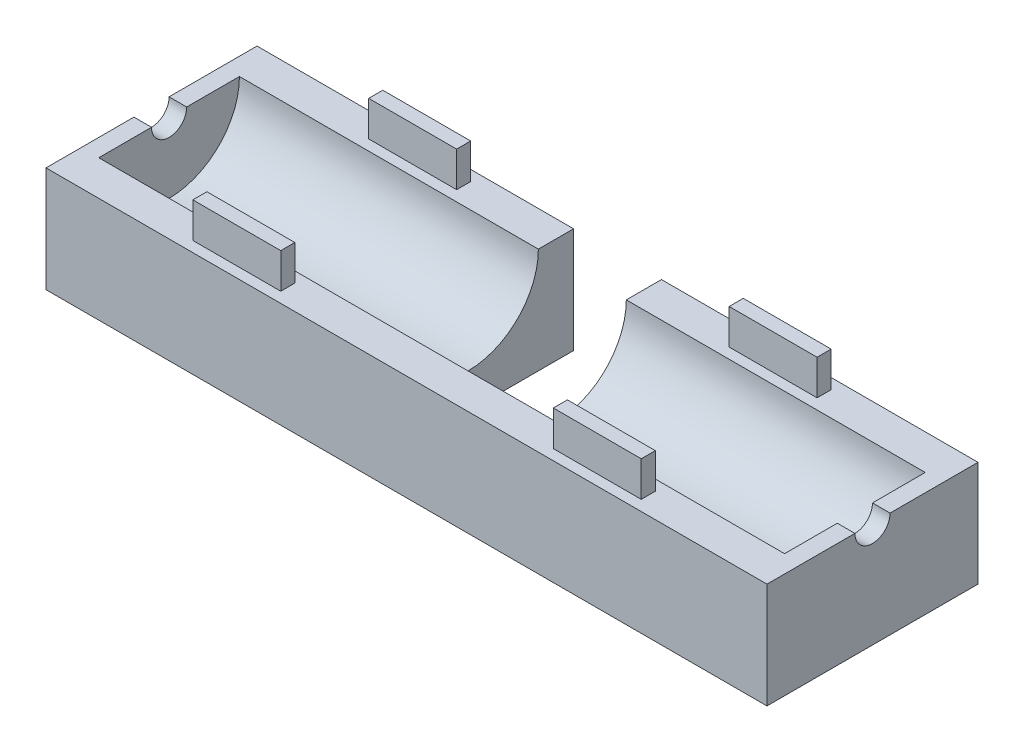
ISO-10303-21;
HEADER;
FILE_DESCRIPTION(('STEP AP214'),'2;1');
FILE_NAME('part.step','',(''),(''),'','','');
FILE_SCHEMA(('AUTOMOTIVE_DESIGN { 1 0 10303 214 1 1 1 1 }'));
ENDSEC;
DATA;
#1=APPLICATION_CONTEXT('core data for automotive mechanical design processes');
#2=APPLICATION_PROTOCOL_DEFINITION('international standard','automotive_design',2000,#1);
#3=PRODUCT_CONTEXT('',#1,'mechanical');
#4=PRODUCT('Part','Part','',(#3));
#5=PRODUCT_RELATED_PRODUCT_CATEGORY('part','',(#4));
#6=PRODUCT_DEFINITION_FORMATION('','',#4);
#7=PRODUCT_DEFINITION_CONTEXT('part definition',#1,'design');
#8=PRODUCT_DEFINITION('design','',#6,#7);
#9=PRODUCT_DEFINITION_SHAPE('','',#8);
#10=(LENGTH_UNIT() NAMED_UNIT(*) SI_UNIT(.MILLI.,.METRE.));
#11=(NAMED_UNIT(*) PLANE_ANGLE_UNIT() SI_UNIT($,.RADIAN.));
#12=(NAMED_UNIT(*) SI_UNIT($,.STERADIAN.) SOLID_ANGLE_UNIT());
#13=UNCERTAINTY_MEASURE_WITH_UNIT(LENGTH_MEASURE(1.E-05),#10,'distance_accuracy_value','');
#14=(GEOMETRIC_REPRESENTATION_CONTEXT(3) GLOBAL_UNCERTAINTY_ASSIGNED_CONTEXT((#13)) GLOBAL_UNIT_ASSIGNED_CONTEXT((#10,
#11,#12)) REPRESENTATION_CONTEXT('',''));
#15=CARTESIAN_POINT('',(0.,0.,0.));
#16=DIRECTION('',(0.,0.,1.));
#17=DIRECTION('',(1.,0.,0.));
#18=AXIS2_PLACEMENT_3D('',#15,#16,#17);
#19=CARTESIAN_POINT('',(20.5,6.,-4.));
#20=DIRECTION('',(0.,-1.,0.));
#21=DIRECTION('',(0.,0.,-1.));
#22=AXIS2_PLACEMENT_3D('',#19,#20,#21);
#23=PLANE('',#22);
#24=DIRECTION('',(-1.,0.,0.));
#25=VECTOR('',#24,1.);
#26=CARTESIAN_POINT('',(20.5,6.,-6.));
#27=LINE('',#26,#25);
#28=CARTESIAN_POINT('',(20.5,6.,-6.));
#29=VERTEX_POINT('',#28);
#30=CARTESIAN_POINT('',(2.5,6.,-6.));
#31=VERTEX_POINT('',#30);
#32=EDGE_CURVE('E457',#29,#31,#27,.T.);
#33=ORIENTED_EDGE('',*,*,#32,.T.);
#34=DIRECTION('',(0.,0.,1.));
#35=VECTOR('',#34,1.);
#36=CARTESIAN_POINT('',(2.5,6.,-4.));
#37=LINE('',#36,#35);
#38=CARTESIAN_POINT('',(2.5,6.,-4.));
#39=VERTEX_POINT('',#38);
#40=EDGE_CURVE('E411',#31,#39,#37,.T.);
#41=ORIENTED_EDGE('',*,*,#40,.T.);
#42=DIRECTION('',(-1.,0.,0.));
#43=VECTOR('',#42,1.);
#44=CARTESIAN_POINT('',(20.5,6.,-4.));
#45=LINE('',#44,#43);
#46=CARTESIAN_POINT('',(19.5,6.,-4.));
#47=VERTEX_POINT('',#46);
#48=EDGE_CURVE('E454',#47,#39,#45,.T.);
#49=ORIENTED_EDGE('',*,*,#48,.F.);
#50=DIRECTION('',(0.,0.,-1.));
#51=VECTOR('',#50,1.);
#52=CARTESIAN_POINT('',(19.5,6.,-4.));
#53=LINE('',#52,#51);
#54=CARTESIAN_POINT('',(19.5,6.,-1.));
#55=VERTEX_POINT('',#54);
#56=EDGE_CURVE('E369',#55,#47,#53,.T.);
#57=ORIENTED_EDGE('',*,*,#56,.F.);
#58=DIRECTION('',(1.,0.,0.));
#59=VECTOR('',#58,1.);
#60=CARTESIAN_POINT('',(19.5,6.,-1.));
#61=LINE('',#60,#59);
#62=CARTESIAN_POINT('',(20.5,6.,-1.));
#63=VERTEX_POINT('',#62);
#64=EDGE_CURVE('E374',#55,#63,#61,.T.);
#65=ORIENTED_EDGE('',*,*,#64,.T.);
#66=DIRECTION('',(0.,0.,1.));
#67=VECTOR('',#66,1.);
#68=CARTESIAN_POINT('',(20.5,6.,-4.));
#69=LINE('',#68,#67);
#70=EDGE_CURVE('E433',#29,#63,#69,.T.);
#71=ORIENTED_EDGE('',*,*,#70,.F.);
#72=EDGE_LOOP('',(#33,#41,#49,#57,#65,#71));
#73=FACE_BOUND('',#72,.T.);
#74=DIRECTION('',(-1.,0.,0.));
#75=VECTOR('',#74,1.);
#76=CARTESIAN_POINT('',(12.75,5.99999999999999,-5.4));
#77=LINE('',#76,#75);
#78=CARTESIAN_POINT('',(12.75,5.99999999999999,-5.4));
#79=VERTEX_POINT('',#78);
#80=CARTESIAN_POINT('',(7.75,6.,-5.4));
#81=VERTEX_POINT('',#80);
#82=EDGE_CURVE('E256',#79,#81,#77,.T.);
#83=ORIENTED_EDGE('',*,*,#82,.F.);
#84=DIRECTION('',(0.,0.,-1.));
#85=VECTOR('',#84,1.);
#86=CARTESIAN_POINT('',(12.75,5.99999999999999,-5.4));
#87=LINE('',#86,#85);
#88=CARTESIAN_POINT('',(12.75,6.,-4.6));
#89=VERTEX_POINT('',#88);
#90=EDGE_CURVE('E253',#89,#79,#87,.T.);
#91=ORIENTED_EDGE('',*,*,#90,.F.);
#92=DIRECTION('',(1.,0.,0.));
#93=VECTOR('',#92,1.);
#94=CARTESIAN_POINT('',(12.75,5.99999999999999,-4.6));
#95=LINE('',#94,#93);
#96=CARTESIAN_POINT('',(7.75,6.,-4.6));
#97=VERTEX_POINT('',#96);
#98=EDGE_CURVE('E53',#97,#89,#95,.T.);
#99=ORIENTED_EDGE('',*,*,#98,.F.);
#100=DIRECTION('',(0.,0.,1.));
#101=VECTOR('',#100,1.);
#102=CARTESIAN_POINT('',(7.75,5.99999999999999,-5.4));
#103=LINE('',#102,#101);
#104=EDGE_CURVE('E48',#81,#97,#103,.T.);
#105=ORIENTED_EDGE('',*,*,#104,.F.);
#106=EDGE_LOOP('',(#83,#91,#99,#105));
#107=FACE_BOUND('',#106,.T.);
#108=ADVANCED_FACE('F33',(#73,#107),#23,.F.);
#109=CARTESIAN_POINT('',(20.5,6.,6.));
#110=DIRECTION('',(0.,-1.,0.));
#111=DIRECTION('',(0.,0.,-1.));
#112=AXIS2_PLACEMENT_3D('',#109,#110,#111);
#113=PLANE('',#112);
#114=DIRECTION('',(1.,0.,0.));
#115=VECTOR('',#114,1.);
#116=CARTESIAN_POINT('',(-12.75,5.99999999999999,5.4));
#117=LINE('',#116,#115);
#118=CARTESIAN_POINT('',(-12.75,5.99999999999999,5.4));
#119=VERTEX_POINT('',#118);
#120=CARTESIAN_POINT('',(-7.75,6.,5.4));
#121=VERTEX_POINT('',#120);
#122=EDGE_CURVE('E295',#119,#121,#117,.T.);
#123=ORIENTED_EDGE('',*,*,#122,.F.);
#124=DIRECTION('',(0.,0.,1.));
#125=VECTOR('',#124,1.);
#126=CARTESIAN_POINT('',(-12.75,5.99999999999999,5.4));
#127=LINE('',#126,#125);
#128=CARTESIAN_POINT('',(-12.75,6.,4.6));
#129=VERTEX_POINT('',#128);
#130=EDGE_CURVE('E300',#129,#119,#127,.T.);
#131=ORIENTED_EDGE('',*,*,#130,.F.);
#132=DIRECTION('',(-1.,0.,0.));
#133=VECTOR('',#132,1.);
#134=CARTESIAN_POINT('',(-12.75,5.99999999999999,4.6));
#135=LINE('',#134,#133);
#136=CARTESIAN_POINT('',(-7.75,6.,4.6));
#137=VERTEX_POINT('',#136);
#138=EDGE_CURVE('E312',#137,#129,#135,.T.);
#139=ORIENTED_EDGE('',*,*,#138,.F.);
#140=DIRECTION('',(0.,0.,-1.));
#141=VECTOR('',#140,1.);
#142=CARTESIAN_POINT('',(-7.75,5.99999999999999,5.4));
#143=LINE('',#142,#141);
#144=EDGE_CURVE('E309',#121,#137,#143,.T.);
#145=ORIENTED_EDGE('',*,*,#144,.F.);
#146=EDGE_LOOP('',(#123,#131,#139,#145));
#147=FACE_BOUND('',#146,.T.);
#148=DIRECTION('',(0.,0.,1.));
#149=VECTOR('',#148,1.);
#150=CARTESIAN_POINT('',(-20.5,6.,6.));
#151=LINE('',#150,#149);
#152=CARTESIAN_POINT('',(-20.5,6.,1.));
#153=VERTEX_POINT('',#152);
#154=CARTESIAN_POINT('',(-20.5,6.,6.));
#155=VERTEX_POINT('',#154);
#156=EDGE_CURVE('E429',#153,#155,#151,.T.);
#157=ORIENTED_EDGE('',*,*,#156,.T.);
#158=DIRECTION('',(-1.,0.,0.));
#159=VECTOR('',#158,1.);
#160=CARTESIAN_POINT('',(20.5,6.,6.));
#161=LINE('',#160,#159);
#162=CARTESIAN_POINT('',(20.5,6.,6.));
#163=VERTEX_POINT('',#162);
#164=EDGE_CURVE('E437',#163,#155,#161,.T.);
#165=ORIENTED_EDGE('',*,*,#164,.F.);
#166=DIRECTION('',(0.,0.,1.));
#167=VECTOR('',#166,1.);
#168=CARTESIAN_POINT('',(20.5,6.,6.));
#169=LINE('',#168,#167);
#170=CARTESIAN_POINT('',(20.5,6.,1.));
#171=VERTEX_POINT('',#170);
#172=EDGE_CURVE('E435',#171,#163,#169,.T.);
#173=ORIENTED_EDGE('',*,*,#172,.F.);
#174=DIRECTION('',(1.,0.,0.));
#175=VECTOR('',#174,1.);
#176=CARTESIAN_POINT('',(19.5,6.,1.));
#177=LINE('',#176,#175);
#178=CARTESIAN_POINT('',(19.5,6.,1.));
#179=VERTEX_POINT('',#178);
#180=EDGE_CURVE('E371',#179,#171,#177,.T.);
#181=ORIENTED_EDGE('',*,*,#180,.F.);
#182=DIRECTION('',(0.,0.,-1.));
#183=VECTOR('',#182,1.);
#184=CARTESIAN_POINT('',(19.5,6.,1.));
#185=LINE('',#184,#183);
#186=CARTESIAN_POINT('',(19.5,6.,4.));
#187=VERTEX_POINT('',#186);
#188=EDGE_CURVE('E365',#187,#179,#185,.T.);
#189=ORIENTED_EDGE('',*,*,#188,.F.);
#190=DIRECTION('',(-1.,0.,0.));
#191=VECTOR('',#190,1.);
#192=CARTESIAN_POINT('',(20.5,6.,4.));
#193=LINE('',#192,#191);
#194=CARTESIAN_POINT('',(-19.5,6.,4.));
#195=VERTEX_POINT('',#194);
#196=EDGE_CURVE('E451',#187,#195,#193,.T.);
#197=ORIENTED_EDGE('',*,*,#196,.T.);
#198=DIRECTION('',(0.,0.,-1.));
#199=VECTOR('',#198,1.);
#200=CARTESIAN_POINT('',(-19.5,6.,1.));
#201=LINE('',#200,#199);
#202=CARTESIAN_POINT('',(-19.5,6.,1.));
#203=VERTEX_POINT('',#202);
#204=EDGE_CURVE('E389',#195,#203,#201,.T.);
#205=ORIENTED_EDGE('',*,*,#204,.T.);
#206=DIRECTION('',(-1.,0.,0.));
#207=VECTOR('',#206,1.);
#208=CARTESIAN_POINT('',(-19.5,6.,1.));
#209=LINE('',#208,#207);
#210=EDGE_CURVE('E395',#203,#153,#209,.T.);
#211=ORIENTED_EDGE('',*,*,#210,.T.);
#212=EDGE_LOOP('',(#157,#165,#173,#181,#189,#197,#205,#211));
#213=FACE_BOUND('',#212,.T.);
#214=DIRECTION('',(0.,0.,-1.));
#215=VECTOR('',#214,1.);
#216=CARTESIAN_POINT('',(12.75,5.99999999999999,5.4));
#217=LINE('',#216,#215);
#218=CARTESIAN_POINT('',(12.75,5.99999999999999,5.4));
#219=VERTEX_POINT('',#218);
#220=CARTESIAN_POINT('',(12.75,6.,4.6));
#221=VERTEX_POINT('',#220);
#222=EDGE_CURVE('E257',#219,#221,#217,.T.);
#223=ORIENTED_EDGE('',*,*,#222,.F.);
#224=DIRECTION('',(1.,0.,0.));
#225=VECTOR('',#224,1.);
#226=CARTESIAN_POINT('',(12.75,5.99999999999999,5.4));
#227=LINE('',#226,#225);
#228=CARTESIAN_POINT('',(7.75,6.,5.4));
#229=VERTEX_POINT('',#228);
#230=EDGE_CURVE('E270',#229,#219,#227,.T.);
#231=ORIENTED_EDGE('',*,*,#230,.F.);
#232=DIRECTION('',(0.,0.,1.));
#233=VECTOR('',#232,1.);
#234=CARTESIAN_POINT('',(7.75,5.99999999999999,5.4));
#235=LINE('',#234,#233);
#236=CARTESIAN_POINT('',(7.75,6.,4.6));
#237=VERTEX_POINT('',#236);
#238=EDGE_CURVE('E279',#237,#229,#235,.T.);
#239=ORIENTED_EDGE('',*,*,#238,.F.);
#240=DIRECTION('',(-1.,0.,0.));
#241=VECTOR('',#240,1.);
#242=CARTESIAN_POINT('',(12.75,5.99999999999999,4.6));
#243=LINE('',#242,#241);
#244=EDGE_CURVE('E260',#221,#237,#243,.T.);
#245=ORIENTED_EDGE('',*,*,#244,.F.);
#246=EDGE_LOOP('',(#223,#231,#239,#245));
#247=FACE_BOUND('',#246,.T.);
#248=ADVANCED_FACE('F505',(#147,#213,#247),#113,.F.);
#249=CARTESIAN_POINT('',(-2.5,6.,-4.));
#250=VERTEX_POINT('',#249);
#251=CARTESIAN_POINT('',(-19.5,6.,-4.));
#252=VERTEX_POINT('',#251);
#253=EDGE_CURVE('E453',#250,#252,#45,.T.);
#254=ORIENTED_EDGE('',*,*,#253,.F.);
#255=DIRECTION('',(0.,0.,-1.));
#256=VECTOR('',#255,1.);
#257=CARTESIAN_POINT('',(-2.5,6.,-4.));
#258=LINE('',#257,#256);
#259=CARTESIAN_POINT('',(-2.5,6.,-6.));
#260=VERTEX_POINT('',#259);
#261=EDGE_CURVE('E418',#250,#260,#258,.T.);
#262=ORIENTED_EDGE('',*,*,#261,.T.);
#263=CARTESIAN_POINT('',(-20.5,6.,-6.));
#264=VERTEX_POINT('',#263);
#265=EDGE_CURVE('E456',#260,#264,#27,.T.);
#266=ORIENTED_EDGE('',*,*,#265,.T.);
#267=DIRECTION('',(0.,0.,1.));
#268=VECTOR('',#267,1.);
#269=CARTESIAN_POINT('',(-20.5,6.,-4.));
#270=LINE('',#269,#268);
#271=CARTESIAN_POINT('',(-20.5,6.,-1.));
#272=VERTEX_POINT('',#271);
#273=EDGE_CURVE('E446',#264,#272,#270,.T.);
#274=ORIENTED_EDGE('',*,*,#273,.T.);
#275=DIRECTION('',(-1.,0.,0.));
#276=VECTOR('',#275,1.);
#277=CARTESIAN_POINT('',(-19.5,6.,-1.));
#278=LINE('',#277,#276);
#279=CARTESIAN_POINT('',(-19.5,6.,-1.));
#280=VERTEX_POINT('',#279);
#281=EDGE_CURVE('E392',#280,#272,#278,.T.);
#282=ORIENTED_EDGE('',*,*,#281,.F.);
#283=DIRECTION('',(0.,0.,-1.));
#284=VECTOR('',#283,1.);
#285=CARTESIAN_POINT('',(-19.5,6.,-4.));
#286=LINE('',#285,#284);
#287=EDGE_CURVE('E383',#280,#252,#286,.T.);
#288=ORIENTED_EDGE('',*,*,#287,.T.);
#289=EDGE_LOOP('',(#254,#262,#266,#274,#282,#288));
#290=FACE_BOUND('',#289,.T.);
#291=DIRECTION('',(0.,0.,1.));
#292=VECTOR('',#291,1.);
#293=CARTESIAN_POINT('',(-12.75,5.99999999999999,-5.4));
#294=LINE('',#293,#292);
#295=CARTESIAN_POINT('',(-12.75,5.99999999999999,-5.4));
#296=VERTEX_POINT('',#295);
#297=CARTESIAN_POINT('',(-12.75,6.,-4.6));
#298=VERTEX_POINT('',#297);
#299=EDGE_CURVE('E328',#296,#298,#294,.T.);
#300=ORIENTED_EDGE('',*,*,#299,.F.);
#301=DIRECTION('',(-1.,0.,0.));
#302=VECTOR('',#301,1.);
#303=CARTESIAN_POINT('',(-12.75,5.99999999999999,-5.4));
#304=LINE('',#303,#302);
#305=CARTESIAN_POINT('',(-7.75,6.,-5.4));
#306=VERTEX_POINT('',#305);
#307=EDGE_CURVE('E333',#306,#296,#304,.T.);
#308=ORIENTED_EDGE('',*,*,#307,.F.);
#309=DIRECTION('',(0.,0.,-1.));
#310=VECTOR('',#309,1.);
#311=CARTESIAN_POINT('',(-7.75,5.99999999999999,-5.4));
#312=LINE('',#311,#310);
#313=CARTESIAN_POINT('',(-7.75,6.,-4.6));
#314=VERTEX_POINT('',#313);
#315=EDGE_CURVE('E345',#314,#306,#312,.T.);
#316=ORIENTED_EDGE('',*,*,#315,.F.);
#317=DIRECTION('',(1.,0.,0.));
#318=VECTOR('',#317,1.);
#319=CARTESIAN_POINT('',(-12.75,5.99999999999999,-4.6));
#320=LINE('',#319,#318);
#321=EDGE_CURVE('E342',#298,#314,#320,.T.);
#322=ORIENTED_EDGE('',*,*,#321,.F.);
#323=EDGE_LOOP('',(#300,#308,#316,#322));
#324=FACE_BOUND('',#323,.T.);
#325=ADVANCED_FACE('F485',(#290,#324),#23,.F.);
#326=CARTESIAN_POINT('',(20.5,6.,0.));
#327=DIRECTION('',(-1.,0.,0.));
#328=DIRECTION('',(0.,0.,1.));
#329=AXIS2_PLACEMENT_3D('',#326,#327,#328);
#330=CYLINDRICAL_SURFACE('',#329,4.);
#331=CARTESIAN_POINT('',(19.5,6.,0.));
#332=DIRECTION('',(-1.,0.,0.));
#333=DIRECTION('',(0.,0.,1.));
#334=AXIS2_PLACEMENT_3D('',#331,#332,#333);
#335=CIRCLE('',#334,4.);
#336=EDGE_CURVE('E367',#47,#187,#335,.T.);
#337=ORIENTED_EDGE('',*,*,#336,.F.);
#338=ORIENTED_EDGE('',*,*,#48,.T.);
#339=CARTESIAN_POINT('',(2.5,6.,0.));
#340=DIRECTION('',(1.,0.,0.));
#341=DIRECTION('',(0.,0.,-1.));
#342=AXIS2_PLACEMENT_3D('',#339,#340,#341);
#343=CIRCLE('',#342,4.);
#344=CARTESIAN_POINT('',(2.5,2.,0.));
#345=VERTEX_POINT('',#344);
#346=EDGE_CURVE('E467',#39,#345,#343,.F.);
#347=ORIENTED_EDGE('',*,*,#346,.T.);
#348=DIRECTION('',(-1.,0.,0.));
#349=VECTOR('',#348,1.);
#350=CARTESIAN_POINT('',(20.5,2.,0.));
#351=LINE('',#350,#349);
#352=CARTESIAN_POINT('',(-2.5,2.00000000000002,0.));
#353=VERTEX_POINT('',#352);
#354=EDGE_CURVE('E41',#345,#353,#351,.T.);
#355=ORIENTED_EDGE('',*,*,#354,.T.);
#356=CARTESIAN_POINT('',(-2.5,6.,0.));
#357=DIRECTION('',(-1.,0.,0.));
#358=DIRECTION('',(0.,0.,1.));
#359=AXIS2_PLACEMENT_3D('',#356,#357,#358);
#360=CIRCLE('',#359,4.);
#361=EDGE_CURVE('E11',#353,#250,#360,.F.);
#362=ORIENTED_EDGE('',*,*,#361,.T.);
#363=ORIENTED_EDGE('',*,*,#253,.T.);
#364=CARTESIAN_POINT('',(-19.5,6.,0.));
#365=DIRECTION('',(-1.,0.,0.));
#366=DIRECTION('',(0.,0.,1.));
#367=AXIS2_PLACEMENT_3D('',#364,#365,#366);
#368=CIRCLE('',#367,4.);
#369=EDGE_CURVE('E386',#252,#195,#368,.T.);
#370=ORIENTED_EDGE('',*,*,#369,.T.);
#371=ORIENTED_EDGE('',*,*,#196,.F.);
#372=EDGE_LOOP('',(#337,#338,#347,#355,#362,#363,#370,#371));
#373=FACE_BOUND('',#372,.T.);
#374=ADVANCED_FACE('F473',(#373),#330,.F.);
#375=CARTESIAN_POINT('',(20.5,6.,-6.));
#376=DIRECTION('',(0.,0.,1.));
#377=DIRECTION('',(0.,-1.,0.));
#378=AXIS2_PLACEMENT_3D('',#375,#376,#377);
#379=PLANE('',#378);
#380=ORIENTED_EDGE('',*,*,#265,.F.);
#381=DIRECTION('',(0.,-1.,0.));
#382=VECTOR('',#381,1.);
#383=CARTESIAN_POINT('',(-2.5,6.,-6.));
#384=LINE('',#383,#382);
#385=CARTESIAN_POINT('',(-2.5,0.,-6.));
#386=VERTEX_POINT('',#385);
#387=EDGE_CURVE('E421',#260,#386,#384,.T.);
#388=ORIENTED_EDGE('',*,*,#387,.T.);
#389=DIRECTION('',(-1.,0.,0.));
#390=VECTOR('',#389,1.);
#391=CARTESIAN_POINT('',(20.5,0.,-6.));
#392=LINE('',#391,#390);
#393=CARTESIAN_POINT('',(-20.5,0.,-6.));
#394=VERTEX_POINT('',#393);
#395=EDGE_CURVE('E460',#386,#394,#392,.T.);
#396=ORIENTED_EDGE('',*,*,#395,.T.);
#397=DIRECTION('',(0.,1.,0.));
#398=VECTOR('',#397,1.);
#399=CARTESIAN_POINT('',(-20.5,6.,-6.));
#400=LINE('',#399,#398);
#401=EDGE_CURVE('E443',#394,#264,#400,.T.);
#402=ORIENTED_EDGE('',*,*,#401,.T.);
#403=EDGE_LOOP('',(#380,#388,#396,#402));
#404=FACE_BOUND('',#403,.T.);
#405=ADVANCED_FACE('F488',(#404),#379,.F.);
#406=CARTESIAN_POINT('',(20.5,6.,6.));
#407=DIRECTION('',(0.,0.,-1.));
#408=DIRECTION('',(0.,1.,0.));
#409=AXIS2_PLACEMENT_3D('',#406,#407,#408);
#410=PLANE('',#409);
#411=DIRECTION('',(0.,-1.,0.));
#412=VECTOR('',#411,1.);
#413=CARTESIAN_POINT('',(-20.5,6.,6.));
#414=LINE('',#413,#412);
#415=CARTESIAN_POINT('',(-20.5,0.,6.));
#416=VERTEX_POINT('',#415);
#417=EDGE_CURVE('E424',#155,#416,#414,.T.);
#418=ORIENTED_EDGE('',*,*,#417,.T.);
#419=DIRECTION('',(-1.,0.,0.));
#420=VECTOR('',#419,1.);
#421=CARTESIAN_POINT('',(20.5,0.,6.));
#422=LINE('',#421,#420);
#423=CARTESIAN_POINT('',(20.5,0.,6.));
#424=VERTEX_POINT('',#423);
#425=EDGE_CURVE('E464',#424,#416,#422,.T.);
#426=ORIENTED_EDGE('',*,*,#425,.F.);
#427=DIRECTION('',(0.,-1.,0.));
#428=VECTOR('',#427,1.);
#429=CARTESIAN_POINT('',(20.5,6.,6.));
#430=LINE('',#429,#428);
#431=EDGE_CURVE('E425',#163,#424,#430,.T.);
#432=ORIENTED_EDGE('',*,*,#431,.F.);
#433=ORIENTED_EDGE('',*,*,#164,.T.);
#434=EDGE_LOOP('',(#418,#426,#432,#433));
#435=FACE_BOUND('',#434,.T.);
#436=ADVANCED_FACE('F35',(#435),#410,.F.);
#437=CARTESIAN_POINT('',(20.5,0.,6.));
#438=DIRECTION('',(0.,1.,0.));
#439=DIRECTION('',(0.,0.,1.));
#440=AXIS2_PLACEMENT_3D('',#437,#438,#439);
#441=PLANE('',#440);
#442=ORIENTED_EDGE('',*,*,#395,.F.);
#443=DIRECTION('',(0.,0.,-1.));
#444=VECTOR('',#443,1.);
#445=CARTESIAN_POINT('',(-2.5,0.,0.));
#446=LINE('',#445,#444);
#447=CARTESIAN_POINT('',(-2.5,0.,0.));
#448=VERTEX_POINT('',#447);
#449=EDGE_CURVE('E398',#448,#386,#446,.T.);
#450=ORIENTED_EDGE('',*,*,#449,.F.);
#451=DIRECTION('',(-1.,0.,0.));
#452=VECTOR('',#451,1.);
#453=CARTESIAN_POINT('',(-2.5,0.,0.));
#454=LINE('',#453,#452);
#455=CARTESIAN_POINT('',(2.5,0.,0.));
#456=VERTEX_POINT('',#455);
#457=EDGE_CURVE('E405',#456,#448,#454,.T.);
#458=ORIENTED_EDGE('',*,*,#457,.F.);
#459=DIRECTION('',(0.,0.,1.));
#460=VECTOR('',#459,1.);
#461=CARTESIAN_POINT('',(2.5,0.,0.));
#462=LINE('',#461,#460);
#463=CARTESIAN_POINT('',(2.5,0.,-6.));
#464=VERTEX_POINT('',#463);
#465=EDGE_CURVE('E402',#464,#456,#462,.T.);
#466=ORIENTED_EDGE('',*,*,#465,.F.);
#467=CARTESIAN_POINT('',(20.5,0.,-6.));
#468=VERTEX_POINT('',#467);
#469=EDGE_CURVE('E461',#468,#464,#392,.T.);
#470=ORIENTED_EDGE('',*,*,#469,.F.);
#471=DIRECTION('',(0.,0.,-1.));
#472=VECTOR('',#471,1.);
#473=CARTESIAN_POINT('',(20.5,0.,6.));
#474=LINE('',#473,#472);
#475=EDGE_CURVE('E428',#424,#468,#474,.T.);
#476=ORIENTED_EDGE('',*,*,#475,.F.);
#477=ORIENTED_EDGE('',*,*,#425,.T.);
#478=DIRECTION('',(0.,0.,-1.));
#479=VECTOR('',#478,1.);
#480=CARTESIAN_POINT('',(-20.5,0.,6.));
#481=LINE('',#480,#479);
#482=EDGE_CURVE('E440',#416,#394,#481,.T.);
#483=ORIENTED_EDGE('',*,*,#482,.T.);
#484=EDGE_LOOP('',(#442,#450,#458,#466,#470,#476,#477,#483));
#485=FACE_BOUND('',#484,.T.);
#486=ADVANCED_FACE('F523',(#485),#441,.F.);
#487=ORIENTED_EDGE('',*,*,#469,.T.);
#488=DIRECTION('',(0.,1.,0.));
#489=VECTOR('',#488,1.);
#490=CARTESIAN_POINT('',(2.5,6.,-6.));
#491=LINE('',#490,#489);
#492=EDGE_CURVE('E415',#464,#31,#491,.T.);
#493=ORIENTED_EDGE('',*,*,#492,.T.);
#494=ORIENTED_EDGE('',*,*,#32,.F.);
#495=DIRECTION('',(0.,1.,0.));
#496=VECTOR('',#495,1.);
#497=CARTESIAN_POINT('',(20.5,6.,-6.));
#498=LINE('',#497,#496);
#499=EDGE_CURVE('E431',#468,#29,#498,.T.);
#500=ORIENTED_EDGE('',*,*,#499,.F.);
#501=EDGE_LOOP('',(#487,#493,#494,#500));
#502=FACE_BOUND('',#501,.T.);
#503=ADVANCED_FACE('F519',(#502),#379,.F.);
#504=CARTESIAN_POINT('',(20.5,6.,0.));
#505=DIRECTION('',(1.,0.,0.));
#506=DIRECTION('',(0.,0.,-1.));
#507=AXIS2_PLACEMENT_3D('',#504,#505,#506);
#508=PLANE('',#507);
#509=ORIENTED_EDGE('',*,*,#431,.T.);
#510=ORIENTED_EDGE('',*,*,#475,.T.);
#511=ORIENTED_EDGE('',*,*,#499,.T.);
#512=ORIENTED_EDGE('',*,*,#70,.T.);
#513=CARTESIAN_POINT('',(20.5,6.,0.));
#514=DIRECTION('',(1.,0.,0.));
#515=DIRECTION('',(0.,0.,1.));
#516=AXIS2_PLACEMENT_3D('',#513,#514,#515);
#517=CIRCLE('',#516,1.);
#518=EDGE_CURVE('E361',#171,#63,#517,.T.);
#519=ORIENTED_EDGE('',*,*,#518,.F.);
#520=ORIENTED_EDGE('',*,*,#172,.T.);
#521=EDGE_LOOP('',(#509,#510,#511,#512,#519,#520));
#522=FACE_BOUND('',#521,.T.);
#523=ADVANCED_FACE('F534',(#522),#508,.T.);
#524=CARTESIAN_POINT('',(-20.5,6.,0.));
#525=DIRECTION('',(1.,0.,0.));
#526=DIRECTION('',(0.,0.,-1.));
#527=AXIS2_PLACEMENT_3D('',#524,#525,#526);
#528=PLANE('',#527);
#529=ORIENTED_EDGE('',*,*,#417,.F.);
#530=ORIENTED_EDGE('',*,*,#156,.F.);
#531=CARTESIAN_POINT('',(-20.5,6.,0.));
#532=DIRECTION('',(1.,0.,0.));
#533=DIRECTION('',(0.,0.,1.));
#534=AXIS2_PLACEMENT_3D('',#531,#532,#533);
#535=CIRCLE('',#534,1.);
#536=EDGE_CURVE('E377',#153,#272,#535,.T.);
#537=ORIENTED_EDGE('',*,*,#536,.T.);
#538=ORIENTED_EDGE('',*,*,#273,.F.);
#539=ORIENTED_EDGE('',*,*,#401,.F.);
#540=ORIENTED_EDGE('',*,*,#482,.F.);
#541=EDGE_LOOP('',(#529,#530,#537,#538,#539,#540));
#542=FACE_BOUND('',#541,.T.);
#543=ADVANCED_FACE('F494',(#542),#528,.F.);
#544=CARTESIAN_POINT('',(-2.5,45.,0.));
#545=DIRECTION('',(-1.,0.,0.));
#546=DIRECTION('',(0.,0.,1.));
#547=AXIS2_PLACEMENT_3D('',#544,#545,#546);
#548=PLANE('',#547);
#549=ORIENTED_EDGE('',*,*,#261,.F.);
#550=ORIENTED_EDGE('',*,*,#361,.F.);
#551=DIRECTION('',(0.,-1.,0.));
#552=VECTOR('',#551,1.);
#553=CARTESIAN_POINT('',(-2.5,45.,0.));
#554=LINE('',#553,#552);
#555=EDGE_CURVE('E409',#353,#448,#554,.T.);
#556=ORIENTED_EDGE('',*,*,#555,.T.);
#557=ORIENTED_EDGE('',*,*,#449,.T.);
#558=ORIENTED_EDGE('',*,*,#387,.F.);
#559=EDGE_LOOP('',(#549,#550,#556,#557,#558));
#560=FACE_BOUND('',#559,.T.);
#561=ADVANCED_FACE('F482',(#560),#548,.F.);
#562=CARTESIAN_POINT('',(-2.5,45.,0.));
#563=DIRECTION('',(0.,0.,1.));
#564=DIRECTION('',(1.,0.,0.));
#565=AXIS2_PLACEMENT_3D('',#562,#563,#564);
#566=PLANE('',#565);
#567=DIRECTION('',(0.,-1.,0.));
#568=VECTOR('',#567,1.);
#569=CARTESIAN_POINT('',(2.5,45.,0.));
#570=LINE('',#569,#568);
#571=EDGE_CURVE('E408',#345,#456,#570,.T.);
#572=ORIENTED_EDGE('',*,*,#571,.T.);
#573=ORIENTED_EDGE('',*,*,#457,.T.);
#574=ORIENTED_EDGE('',*,*,#555,.F.);
#575=ORIENTED_EDGE('',*,*,#354,.F.);
#576=EDGE_LOOP('',(#572,#573,#574,#575));
#577=FACE_BOUND('',#576,.T.);
#578=ADVANCED_FACE('F478',(#577),#566,.F.);
#579=CARTESIAN_POINT('',(2.5,45.,0.));
#580=DIRECTION('',(1.,0.,0.));
#581=DIRECTION('',(0.,0.,-1.));
#582=AXIS2_PLACEMENT_3D('',#579,#580,#581);
#583=PLANE('',#582);
#584=ORIENTED_EDGE('',*,*,#465,.T.);
#585=ORIENTED_EDGE('',*,*,#571,.F.);
#586=ORIENTED_EDGE('',*,*,#346,.F.);
#587=ORIENTED_EDGE('',*,*,#40,.F.);
#588=ORIENTED_EDGE('',*,*,#492,.F.);
#589=EDGE_LOOP('',(#584,#585,#586,#587,#588));
#590=FACE_BOUND('',#589,.T.);
#591=ADVANCED_FACE('F516',(#590),#583,.F.);
#592=CARTESIAN_POINT('',(-19.5,6.,0.));
#593=DIRECTION('',(-1.,0.,0.));
#594=DIRECTION('',(0.,0.,1.));
#595=AXIS2_PLACEMENT_3D('',#592,#593,#594);
#596=CYLINDRICAL_SURFACE('',#595,1.);
#597=ORIENTED_EDGE('',*,*,#536,.F.);
#598=ORIENTED_EDGE('',*,*,#210,.F.);
#599=CARTESIAN_POINT('',(-19.5,6.,0.));
#600=DIRECTION('',(1.,0.,0.));
#601=DIRECTION('',(0.,0.,1.));
#602=AXIS2_PLACEMENT_3D('',#599,#600,#601);
#603=CIRCLE('',#602,1.);
#604=EDGE_CURVE('E380',#203,#280,#603,.T.);
#605=ORIENTED_EDGE('',*,*,#604,.T.);
#606=ORIENTED_EDGE('',*,*,#281,.T.);
#607=EDGE_LOOP('',(#597,#598,#605,#606));
#608=FACE_BOUND('',#607,.T.);
#609=ADVANCED_FACE('F498',(#608),#596,.F.);
#610=CARTESIAN_POINT('',(-19.5,6.,0.));
#611=DIRECTION('',(-1.,0.,0.));
#612=DIRECTION('',(0.,0.,1.));
#613=AXIS2_PLACEMENT_3D('',#610,#611,#612);
#614=PLANE('',#613);
#615=ORIENTED_EDGE('',*,*,#604,.F.);
#616=ORIENTED_EDGE('',*,*,#204,.F.);
#617=ORIENTED_EDGE('',*,*,#369,.F.);
#618=ORIENTED_EDGE('',*,*,#287,.F.);
#619=EDGE_LOOP('',(#615,#616,#617,#618));
#620=FACE_BOUND('',#619,.T.);
#621=ADVANCED_FACE('F502',(#620),#614,.F.);
#622=CARTESIAN_POINT('',(19.5,6.,0.));
#623=DIRECTION('',(1.,0.,0.));
#624=DIRECTION('',(0.,0.,-1.));
#625=AXIS2_PLACEMENT_3D('',#622,#623,#624);
#626=CYLINDRICAL_SURFACE('',#625,1.);
#627=ORIENTED_EDGE('',*,*,#518,.T.);
#628=ORIENTED_EDGE('',*,*,#64,.F.);
#629=CARTESIAN_POINT('',(19.5,6.,0.));
#630=DIRECTION('',(1.,0.,0.));
#631=DIRECTION('',(0.,0.,1.));
#632=AXIS2_PLACEMENT_3D('',#629,#630,#631);
#633=CIRCLE('',#632,1.);
#634=EDGE_CURVE('E362',#179,#55,#633,.T.);
#635=ORIENTED_EDGE('',*,*,#634,.F.);
#636=ORIENTED_EDGE('',*,*,#180,.T.);
#637=EDGE_LOOP('',(#627,#628,#635,#636));
#638=FACE_BOUND('',#637,.T.);
#639=ADVANCED_FACE('F532',(#638),#626,.F.);
#640=CARTESIAN_POINT('',(19.5,6.,0.));
#641=DIRECTION('',(1.,0.,0.));
#642=DIRECTION('',(0.,0.,1.));
#643=AXIS2_PLACEMENT_3D('',#640,#641,#642);
#644=PLANE('',#643);
#645=ORIENTED_EDGE('',*,*,#634,.T.);
#646=ORIENTED_EDGE('',*,*,#56,.T.);
#647=ORIENTED_EDGE('',*,*,#336,.T.);
#648=ORIENTED_EDGE('',*,*,#188,.T.);
#649=EDGE_LOOP('',(#645,#646,#647,#648));
#650=FACE_BOUND('',#649,.T.);
#651=ADVANCED_FACE('F636',(#650),#644,.F.);
#652=CARTESIAN_POINT('',(-12.75,7.99999999999999,-5.4));
#653=DIRECTION('',(1.,0.,0.));
#654=DIRECTION('',(0.,0.,-1.));
#655=AXIS2_PLACEMENT_3D('',#652,#653,#654);
#656=PLANE('',#655);
#657=ORIENTED_EDGE('',*,*,#299,.T.);
#658=DIRECTION('',(0.,-1.,0.));
#659=VECTOR('',#658,1.);
#660=CARTESIAN_POINT('',(-12.75,7.99999999999999,-4.6));
#661=LINE('',#660,#659);
#662=CARTESIAN_POINT('',(-12.75,7.99999999999999,-4.6));
#663=VERTEX_POINT('',#662);
#664=EDGE_CURVE('E358',#663,#298,#661,.T.);
#665=ORIENTED_EDGE('',*,*,#664,.F.);
#666=DIRECTION('',(0.,0.,1.));
#667=VECTOR('',#666,1.);
#668=CARTESIAN_POINT('',(-12.75,7.99999999999999,-5.4));
#669=LINE('',#668,#667);
#670=CARTESIAN_POINT('',(-12.75,7.99999999999999,-5.4));
#671=VERTEX_POINT('',#670);
#672=EDGE_CURVE('E329',#671,#663,#669,.T.);
#673=ORIENTED_EDGE('',*,*,#672,.F.);
#674=DIRECTION('',(0.,-1.,0.));
#675=VECTOR('',#674,1.);
#676=CARTESIAN_POINT('',(-12.75,7.99999999999999,-5.4));
#677=LINE('',#676,#675);
#678=EDGE_CURVE('E339',#671,#296,#677,.T.);
#679=ORIENTED_EDGE('',*,*,#678,.T.);
#680=EDGE_LOOP('',(#657,#665,#673,#679));
#681=FACE_BOUND('',#680,.T.);
#682=ADVANCED_FACE('F644',(#681),#656,.F.);
#683=CARTESIAN_POINT('',(-12.75,7.99999999999999,-4.6));
#684=DIRECTION('',(0.,0.,-1.));
#685=DIRECTION('',(-1.,0.,0.));
#686=AXIS2_PLACEMENT_3D('',#683,#684,#685);
#687=PLANE('',#686);
#688=ORIENTED_EDGE('',*,*,#321,.T.);
#689=DIRECTION('',(0.,-1.,0.));
#690=VECTOR('',#689,1.);
#691=CARTESIAN_POINT('',(-7.75,7.99999999999999,-4.6));
#692=LINE('',#691,#690);
#693=CARTESIAN_POINT('',(-7.75,7.99999999999999,-4.6));
#694=VERTEX_POINT('',#693);
#695=EDGE_CURVE('E355',#694,#314,#692,.T.);
#696=ORIENTED_EDGE('',*,*,#695,.F.);
#697=DIRECTION('',(1.,0.,0.));
#698=VECTOR('',#697,1.);
#699=CARTESIAN_POINT('',(-12.75,7.99999999999999,-4.6));
#700=LINE('',#699,#698);
#701=EDGE_CURVE('E332',#663,#694,#700,.T.);
#702=ORIENTED_EDGE('',*,*,#701,.F.);
#703=ORIENTED_EDGE('',*,*,#664,.T.);
#704=EDGE_LOOP('',(#688,#696,#702,#703));
#705=FACE_BOUND('',#704,.T.);
#706=ADVANCED_FACE('F672',(#705),#687,.F.);
#707=CARTESIAN_POINT('',(-7.75,7.99999999999999,-5.4));
#708=DIRECTION('',(-1.,0.,0.));
#709=DIRECTION('',(0.,0.,1.));
#710=AXIS2_PLACEMENT_3D('',#707,#708,#709);
#711=PLANE('',#710);
#712=ORIENTED_EDGE('',*,*,#315,.T.);
#713=DIRECTION('',(0.,-1.,0.));
#714=VECTOR('',#713,1.);
#715=CARTESIAN_POINT('',(-7.75,7.99999999999999,-5.4));
#716=LINE('',#715,#714);
#717=CARTESIAN_POINT('',(-7.75,7.99999999999999,-5.4));
#718=VERTEX_POINT('',#717);
#719=EDGE_CURVE('E352',#718,#306,#716,.T.);
#720=ORIENTED_EDGE('',*,*,#719,.F.);
#721=DIRECTION('',(0.,0.,-1.));
#722=VECTOR('',#721,1.);
#723=CARTESIAN_POINT('',(-7.75,7.99999999999999,-5.4));
#724=LINE('',#723,#722);
#725=EDGE_CURVE('E335',#694,#718,#724,.T.);
#726=ORIENTED_EDGE('',*,*,#725,.F.);
#727=ORIENTED_EDGE('',*,*,#695,.T.);
#728=EDGE_LOOP('',(#712,#720,#726,#727));
#729=FACE_BOUND('',#728,.T.);
#730=ADVANCED_FACE('F682',(#729),#711,.F.);
#731=CARTESIAN_POINT('',(-12.75,7.99999999999999,-5.4));
#732=DIRECTION('',(0.,0.,1.));
#733=DIRECTION('',(1.,0.,0.));
#734=AXIS2_PLACEMENT_3D('',#731,#732,#733);
#735=PLANE('',#734);
#736=ORIENTED_EDGE('',*,*,#307,.T.);
#737=ORIENTED_EDGE('',*,*,#678,.F.);
#738=DIRECTION('',(-1.,0.,0.));
#739=VECTOR('',#738,1.);
#740=CARTESIAN_POINT('',(-12.75,7.99999999999999,-5.4));
#741=LINE('',#740,#739);
#742=EDGE_CURVE('E337',#718,#671,#741,.T.);
#743=ORIENTED_EDGE('',*,*,#742,.F.);
#744=ORIENTED_EDGE('',*,*,#719,.T.);
#745=EDGE_LOOP('',(#736,#737,#743,#744));
#746=FACE_BOUND('',#745,.T.);
#747=ADVANCED_FACE('F692',(#746),#735,.F.);
#748=CARTESIAN_POINT('',(0.,7.99999999999999,0.));
#749=DIRECTION('',(0.,1.,0.));
#750=DIRECTION('',(0.,0.,1.));
#751=AXIS2_PLACEMENT_3D('',#748,#749,#750);
#752=PLANE('',#751);
#753=ORIENTED_EDGE('',*,*,#672,.T.);
#754=ORIENTED_EDGE('',*,*,#701,.T.);
#755=ORIENTED_EDGE('',*,*,#725,.T.);
#756=ORIENTED_EDGE('',*,*,#742,.T.);
#757=EDGE_LOOP('',(#753,#754,#755,#756));
#758=FACE_BOUND('',#757,.T.);
#759=ADVANCED_FACE('F702',(#758),#752,.T.);
#760=CARTESIAN_POINT('',(-12.75,7.99999999999999,5.4));
#761=DIRECTION('',(0.,0.,-1.));
#762=DIRECTION('',(-1.,0.,0.));
#763=AXIS2_PLACEMENT_3D('',#760,#761,#762);
#764=PLANE('',#763);
#765=ORIENTED_EDGE('',*,*,#122,.T.);
#766=DIRECTION('',(0.,-1.,0.));
#767=VECTOR('',#766,1.);
#768=CARTESIAN_POINT('',(-7.75,7.99999999999999,5.4));
#769=LINE('',#768,#767);
#770=CARTESIAN_POINT('',(-7.75,7.99999999999999,5.4));
#771=VERTEX_POINT('',#770);
#772=EDGE_CURVE('E325',#771,#121,#769,.T.);
#773=ORIENTED_EDGE('',*,*,#772,.F.);
#774=DIRECTION('',(1.,0.,0.));
#775=VECTOR('',#774,1.);
#776=CARTESIAN_POINT('',(-12.75,7.99999999999999,5.4));
#777=LINE('',#776,#775);
#778=CARTESIAN_POINT('',(-12.75,7.99999999999999,5.4));
#779=VERTEX_POINT('',#778);
#780=EDGE_CURVE('E296',#779,#771,#777,.T.);
#781=ORIENTED_EDGE('',*,*,#780,.F.);
#782=DIRECTION('',(0.,-1.,0.));
#783=VECTOR('',#782,1.);
#784=CARTESIAN_POINT('',(-12.75,7.99999999999999,5.4));
#785=LINE('',#784,#783);
#786=EDGE_CURVE('E306',#779,#119,#785,.T.);
#787=ORIENTED_EDGE('',*,*,#786,.T.);
#788=EDGE_LOOP('',(#765,#773,#781,#787));
#789=FACE_BOUND('',#788,.T.);
#790=ADVANCED_FACE('F712',(#789),#764,.F.);
#791=CARTESIAN_POINT('',(-7.75,7.99999999999999,5.4));
#792=DIRECTION('',(-1.,0.,0.));
#793=DIRECTION('',(0.,0.,1.));
#794=AXIS2_PLACEMENT_3D('',#791,#792,#793);
#795=PLANE('',#794);
#796=ORIENTED_EDGE('',*,*,#144,.T.);
#797=DIRECTION('',(0.,-1.,0.));
#798=VECTOR('',#797,1.);
#799=CARTESIAN_POINT('',(-7.75,7.99999999999999,4.6));
#800=LINE('',#799,#798);
#801=CARTESIAN_POINT('',(-7.75,7.99999999999999,4.6));
#802=VERTEX_POINT('',#801);
#803=EDGE_CURVE('E322',#802,#137,#800,.T.);
#804=ORIENTED_EDGE('',*,*,#803,.F.);
#805=DIRECTION('',(0.,0.,-1.));
#806=VECTOR('',#805,1.);
#807=CARTESIAN_POINT('',(-7.75,7.99999999999999,5.4));
#808=LINE('',#807,#806);
#809=EDGE_CURVE('E299',#771,#802,#808,.T.);
#810=ORIENTED_EDGE('',*,*,#809,.F.);
#811=ORIENTED_EDGE('',*,*,#772,.T.);
#812=EDGE_LOOP('',(#796,#804,#810,#811));
#813=FACE_BOUND('',#812,.T.);
#814=ADVANCED_FACE('F722',(#813),#795,.F.);
#815=CARTESIAN_POINT('',(-12.75,7.99999999999999,4.6));
#816=DIRECTION('',(0.,0.,1.));
#817=DIRECTION('',(1.,0.,0.));
#818=AXIS2_PLACEMENT_3D('',#815,#816,#817);
#819=PLANE('',#818);
#820=ORIENTED_EDGE('',*,*,#138,.T.);
#821=DIRECTION('',(0.,-1.,0.));
#822=VECTOR('',#821,1.);
#823=CARTESIAN_POINT('',(-12.75,7.99999999999999,4.6));
#824=LINE('',#823,#822);
#825=CARTESIAN_POINT('',(-12.75,7.99999999999999,4.6));
#826=VERTEX_POINT('',#825);
#827=EDGE_CURVE('E319',#826,#129,#824,.T.);
#828=ORIENTED_EDGE('',*,*,#827,.F.);
#829=DIRECTION('',(-1.,0.,0.));
#830=VECTOR('',#829,1.);
#831=CARTESIAN_POINT('',(-12.75,7.99999999999999,4.6));
#832=LINE('',#831,#830);
#833=EDGE_CURVE('E302',#802,#826,#832,.T.);
#834=ORIENTED_EDGE('',*,*,#833,.F.);
#835=ORIENTED_EDGE('',*,*,#803,.T.);
#836=EDGE_LOOP('',(#820,#828,#834,#835));
#837=FACE_BOUND('',#836,.T.);
#838=ADVANCED_FACE('F732',(#837),#819,.F.);
#839=CARTESIAN_POINT('',(-12.75,7.99999999999999,5.4));
#840=DIRECTION('',(1.,0.,0.));
#841=DIRECTION('',(0.,0.,-1.));
#842=AXIS2_PLACEMENT_3D('',#839,#840,#841);
#843=PLANE('',#842);
#844=ORIENTED_EDGE('',*,*,#130,.T.);
#845=ORIENTED_EDGE('',*,*,#786,.F.);
#846=DIRECTION('',(0.,0.,1.));
#847=VECTOR('',#846,1.);
#848=CARTESIAN_POINT('',(-12.75,7.99999999999999,5.4));
#849=LINE('',#848,#847);
#850=EDGE_CURVE('E304',#826,#779,#849,.T.);
#851=ORIENTED_EDGE('',*,*,#850,.F.);
#852=ORIENTED_EDGE('',*,*,#827,.T.);
#853=EDGE_LOOP('',(#844,#845,#851,#852));
#854=FACE_BOUND('',#853,.T.);
#855=ADVANCED_FACE('F742',(#854),#843,.F.);
#856=CARTESIAN_POINT('',(0.,7.99999999999999,0.));
#857=DIRECTION('',(0.,1.,0.));
#858=DIRECTION('',(0.,0.,1.));
#859=AXIS2_PLACEMENT_3D('',#856,#857,#858);
#860=PLANE('',#859);
#861=ORIENTED_EDGE('',*,*,#780,.T.);
#862=ORIENTED_EDGE('',*,*,#809,.T.);
#863=ORIENTED_EDGE('',*,*,#833,.T.);
#864=ORIENTED_EDGE('',*,*,#850,.T.);
#865=EDGE_LOOP('',(#861,#862,#863,#864));
#866=FACE_BOUND('',#865,.T.);
#867=ADVANCED_FACE('F752',(#866),#860,.T.);
#868=CARTESIAN_POINT('',(12.75,7.99999999999999,5.4));
#869=DIRECTION('',(-1.,0.,0.));
#870=DIRECTION('',(0.,0.,1.));
#871=AXIS2_PLACEMENT_3D('',#868,#869,#870);
#872=PLANE('',#871);
#873=ORIENTED_EDGE('',*,*,#222,.T.);
#874=DIRECTION('',(0.,-1.,0.));
#875=VECTOR('',#874,1.);
#876=CARTESIAN_POINT('',(12.75,7.99999999999999,4.6));
#877=LINE('',#876,#875);
#878=CARTESIAN_POINT('',(12.75,7.99999999999999,4.6));
#879=VERTEX_POINT('',#878);
#880=EDGE_CURVE('E292',#879,#221,#877,.T.);
#881=ORIENTED_EDGE('',*,*,#880,.F.);
#882=DIRECTION('',(0.,0.,-1.));
#883=VECTOR('',#882,1.);
#884=CARTESIAN_POINT('',(12.75,7.99999999999999,5.4));
#885=LINE('',#884,#883);
#886=CARTESIAN_POINT('',(12.75,7.99999999999999,5.4));
#887=VERTEX_POINT('',#886);
#888=EDGE_CURVE('E266',#887,#879,#885,.T.);
#889=ORIENTED_EDGE('',*,*,#888,.F.);
#890=DIRECTION('',(0.,-1.,0.));
#891=VECTOR('',#890,1.);
#892=CARTESIAN_POINT('',(12.75,7.99999999999999,5.4));
#893=LINE('',#892,#891);
#894=EDGE_CURVE('E275',#887,#219,#893,.T.);
#895=ORIENTED_EDGE('',*,*,#894,.T.);
#896=EDGE_LOOP('',(#873,#881,#889,#895));
#897=FACE_BOUND('',#896,.T.);
#898=ADVANCED_FACE('F762',(#897),#872,.F.);
#899=CARTESIAN_POINT('',(12.75,7.99999999999999,4.6));
#900=DIRECTION('',(0.,0.,1.));
#901=DIRECTION('',(1.,0.,0.));
#902=AXIS2_PLACEMENT_3D('',#899,#900,#901);
#903=PLANE('',#902);
#904=ORIENTED_EDGE('',*,*,#244,.T.);
#905=DIRECTION('',(0.,-1.,0.));
#906=VECTOR('',#905,1.);
#907=CARTESIAN_POINT('',(7.75,7.99999999999999,4.6));
#908=LINE('',#907,#906);
#909=CARTESIAN_POINT('',(7.75,7.99999999999999,4.6));
#910=VERTEX_POINT('',#909);
#911=EDGE_CURVE('E289',#910,#237,#908,.T.);
#912=ORIENTED_EDGE('',*,*,#911,.F.);
#913=DIRECTION('',(-1.,0.,0.));
#914=VECTOR('',#913,1.);
#915=CARTESIAN_POINT('',(12.75,7.99999999999999,4.6));
#916=LINE('',#915,#914);
#917=EDGE_CURVE('E269',#879,#910,#916,.T.);
#918=ORIENTED_EDGE('',*,*,#917,.F.);
#919=ORIENTED_EDGE('',*,*,#880,.T.);
#920=EDGE_LOOP('',(#904,#912,#918,#919));
#921=FACE_BOUND('',#920,.T.);
#922=ADVANCED_FACE('F772',(#921),#903,.F.);
#923=CARTESIAN_POINT('',(7.75,7.99999999999999,5.4));
#924=DIRECTION('',(1.,0.,0.));
#925=DIRECTION('',(0.,0.,-1.));
#926=AXIS2_PLACEMENT_3D('',#923,#924,#925);
#927=PLANE('',#926);
#928=ORIENTED_EDGE('',*,*,#238,.T.);
#929=DIRECTION('',(0.,-1.,0.));
#930=VECTOR('',#929,1.);
#931=CARTESIAN_POINT('',(7.75,7.99999999999999,5.4));
#932=LINE('',#931,#930);
#933=CARTESIAN_POINT('',(7.75,7.99999999999999,5.4));
#934=VERTEX_POINT('',#933);
#935=EDGE_CURVE('E286',#934,#229,#932,.T.);
#936=ORIENTED_EDGE('',*,*,#935,.F.);
#937=DIRECTION('',(0.,0.,1.));
#938=VECTOR('',#937,1.);
#939=CARTESIAN_POINT('',(7.75,7.99999999999999,5.4));
#940=LINE('',#939,#938);
#941=EDGE_CURVE('E272',#910,#934,#940,.T.);
#942=ORIENTED_EDGE('',*,*,#941,.F.);
#943=ORIENTED_EDGE('',*,*,#911,.T.);
#944=EDGE_LOOP('',(#928,#936,#942,#943));
#945=FACE_BOUND('',#944,.T.);
#946=ADVANCED_FACE('F782',(#945),#927,.F.);
#947=CARTESIAN_POINT('',(12.75,7.99999999999999,5.4));
#948=DIRECTION('',(0.,0.,-1.));
#949=DIRECTION('',(-1.,0.,0.));
#950=AXIS2_PLACEMENT_3D('',#947,#948,#949);
#951=PLANE('',#950);
#952=ORIENTED_EDGE('',*,*,#230,.T.);
#953=ORIENTED_EDGE('',*,*,#894,.F.);
#954=DIRECTION('',(1.,0.,0.));
#955=VECTOR('',#954,1.);
#956=CARTESIAN_POINT('',(12.75,7.99999999999999,5.4));
#957=LINE('',#956,#955);
#958=EDGE_CURVE('E274',#934,#887,#957,.T.);
#959=ORIENTED_EDGE('',*,*,#958,.F.);
#960=ORIENTED_EDGE('',*,*,#935,.T.);
#961=EDGE_LOOP('',(#952,#953,#959,#960));
#962=FACE_BOUND('',#961,.T.);
#963=ADVANCED_FACE('F792',(#962),#951,.F.);
#964=CARTESIAN_POINT('',(0.,7.99999999999999,0.));
#965=DIRECTION('',(0.,1.,0.));
#966=DIRECTION('',(0.,0.,1.));
#967=AXIS2_PLACEMENT_3D('',#964,#965,#966);
#968=PLANE('',#967);
#969=ORIENTED_EDGE('',*,*,#888,.T.);
#970=ORIENTED_EDGE('',*,*,#917,.T.);
#971=ORIENTED_EDGE('',*,*,#941,.T.);
#972=ORIENTED_EDGE('',*,*,#958,.T.);
#973=EDGE_LOOP('',(#969,#970,#971,#972));
#974=FACE_BOUND('',#973,.T.);
#975=ADVANCED_FACE('F802',(#974),#968,.T.);
#976=CARTESIAN_POINT('',(12.75,7.99999999999999,-5.4));
#977=DIRECTION('',(0.,0.,1.));
#978=DIRECTION('',(1.,0.,0.));
#979=AXIS2_PLACEMENT_3D('',#976,#977,#978);
#980=PLANE('',#979);
#981=ORIENTED_EDGE('',*,*,#82,.T.);
#982=DIRECTION('',(0.,-1.,0.));
#983=VECTOR('',#982,1.);
#984=CARTESIAN_POINT('',(7.75,7.99999999999999,-5.4));
#985=LINE('',#984,#983);
#986=CARTESIAN_POINT('',(7.75,7.99999999999999,-5.4));
#987=VERTEX_POINT('',#986);
#988=EDGE_CURVE('E237',#987,#81,#985,.T.);
#989=ORIENTED_EDGE('',*,*,#988,.F.);
#990=DIRECTION('',(-1.,0.,0.));
#991=VECTOR('',#990,1.);
#992=CARTESIAN_POINT('',(12.75,7.99999999999999,-5.4));
#993=LINE('',#992,#991);
#994=CARTESIAN_POINT('',(12.75,7.99999999999999,-5.4));
#995=VERTEX_POINT('',#994);
#996=EDGE_CURVE('E244',#995,#987,#993,.T.);
#997=ORIENTED_EDGE('',*,*,#996,.F.);
#998=DIRECTION('',(0.,-1.,0.));
#999=VECTOR('',#998,1.);
#1000=CARTESIAN_POINT('',(12.75,7.99999999999999,-5.4));
#1001=LINE('',#1000,#999);
#1002=EDGE_CURVE('E862',#995,#79,#1001,.T.);
#1003=ORIENTED_EDGE('',*,*,#1002,.T.);
#1004=EDGE_LOOP('',(#981,#989,#997,#1003));
#1005=FACE_BOUND('',#1004,.T.);
#1006=ADVANCED_FACE('F255',(#1005),#980,.F.);
#1007=CARTESIAN_POINT('',(7.75,7.99999999999999,-5.4));
#1008=DIRECTION('',(1.,0.,0.));
#1009=DIRECTION('',(0.,0.,-1.));
#1010=AXIS2_PLACEMENT_3D('',#1007,#1008,#1009);
#1011=PLANE('',#1010);
#1012=ORIENTED_EDGE('',*,*,#104,.T.);
#1013=DIRECTION('',(0.,-1.,0.));
#1014=VECTOR('',#1013,1.);
#1015=CARTESIAN_POINT('',(7.75,7.99999999999999,-4.6));
#1016=LINE('',#1015,#1014);
#1017=CARTESIAN_POINT('',(7.75,7.99999999999999,-4.6));
#1018=VERTEX_POINT('',#1017);
#1019=EDGE_CURVE('E240',#1018,#97,#1016,.T.);
#1020=ORIENTED_EDGE('',*,*,#1019,.F.);
#1021=DIRECTION('',(0.,0.,1.));
#1022=VECTOR('',#1021,1.);
#1023=CARTESIAN_POINT('',(7.75,7.99999999999999,-5.4));
#1024=LINE('',#1023,#1022);
#1025=EDGE_CURVE('E233',#987,#1018,#1024,.T.);
#1026=ORIENTED_EDGE('',*,*,#1025,.F.);
#1027=ORIENTED_EDGE('',*,*,#988,.T.);
#1028=EDGE_LOOP('',(#1012,#1020,#1026,#1027));
#1029=FACE_BOUND('',#1028,.T.);
#1030=ADVANCED_FACE('F235',(#1029),#1011,.F.);
#1031=CARTESIAN_POINT('',(12.75,7.99999999999999,-4.6));
#1032=DIRECTION('',(0.,0.,-1.));
#1033=DIRECTION('',(-1.,0.,0.));
#1034=AXIS2_PLACEMENT_3D('',#1031,#1032,#1033);
#1035=PLANE('',#1034);
#1036=ORIENTED_EDGE('',*,*,#98,.T.);
#1037=DIRECTION('',(0.,-1.,0.));
#1038=VECTOR('',#1037,1.);
#1039=CARTESIAN_POINT('',(12.75,7.99999999999999,-4.6));
#1040=LINE('',#1039,#1038);
#1041=CARTESIAN_POINT('',(12.75,7.99999999999999,-4.6));
#1042=VERTEX_POINT('',#1041);
#1043=EDGE_CURVE('E262',#1042,#89,#1040,.T.);
#1044=ORIENTED_EDGE('',*,*,#1043,.F.);
#1045=DIRECTION('',(1.,0.,0.));
#1046=VECTOR('',#1045,1.);
#1047=CARTESIAN_POINT('',(12.75,7.99999999999999,-4.6));
#1048=LINE('',#1047,#1046);
#1049=EDGE_CURVE('E243',#1018,#1042,#1048,.T.);
#1050=ORIENTED_EDGE('',*,*,#1049,.F.);
#1051=ORIENTED_EDGE('',*,*,#1019,.T.);
#1052=EDGE_LOOP('',(#1036,#1044,#1050,#1051));
#1053=FACE_BOUND('',#1052,.T.);
#1054=ADVANCED_FACE('F829',(#1053),#1035,.F.);
#1055=CARTESIAN_POINT('',(12.75,7.99999999999999,-5.4));
#1056=DIRECTION('',(-1.,0.,0.));
#1057=DIRECTION('',(0.,0.,1.));
#1058=AXIS2_PLACEMENT_3D('',#1055,#1056,#1057);
#1059=PLANE('',#1058);
#1060=ORIENTED_EDGE('',*,*,#90,.T.);
#1061=ORIENTED_EDGE('',*,*,#1002,.F.);
#1062=DIRECTION('',(0.,0.,-1.));
#1063=VECTOR('',#1062,1.);
#1064=CARTESIAN_POINT('',(12.75,7.99999999999999,-5.4));
#1065=LINE('',#1064,#1063);
#1066=EDGE_CURVE('E249',#1042,#995,#1065,.T.);
#1067=ORIENTED_EDGE('',*,*,#1066,.F.);
#1068=ORIENTED_EDGE('',*,*,#1043,.T.);
#1069=EDGE_LOOP('',(#1060,#1061,#1067,#1068));
#1070=FACE_BOUND('',#1069,.T.);
#1071=ADVANCED_FACE('F838',(#1070),#1059,.F.);
#1072=CARTESIAN_POINT('',(0.,7.99999999999999,0.));
#1073=DIRECTION('',(0.,1.,0.));
#1074=DIRECTION('',(0.,0.,1.));
#1075=AXIS2_PLACEMENT_3D('',#1072,#1073,#1074);
#1076=PLANE('',#1075);
#1077=ORIENTED_EDGE('',*,*,#996,.T.);
#1078=ORIENTED_EDGE('',*,*,#1025,.T.);
#1079=ORIENTED_EDGE('',*,*,#1049,.T.);
#1080=ORIENTED_EDGE('',*,*,#1066,.T.);
#1081=EDGE_LOOP('',(#1077,#1078,#1079,#1080));
#1082=FACE_BOUND('',#1081,.T.);
#1083=ADVANCED_FACE('F247',(#1082),#1076,.T.);
#1084=CLOSED_SHELL('',(#108,#248,#325,#374,#405,#436,#486,#503,#523,#543,#561,#578,#591,#609,
#621,#639,#651,#682,#706,#730,#747,#759,#790,#814,#838,#855,#867,#898,#922,#946,#963,#975,#1006,
#1030,#1054,#1071,#1083));
#1085=MANIFOLD_SOLID_BREP('B2',#1084);
#1086=ADVANCED_BREP_SHAPE_REPRESENTATION('',(#18,#1085),#14);
#1087=SHAPE_DEFINITION_REPRESENTATION(#9,#1086);
ENDSEC;
END-ISO-10303-21;
